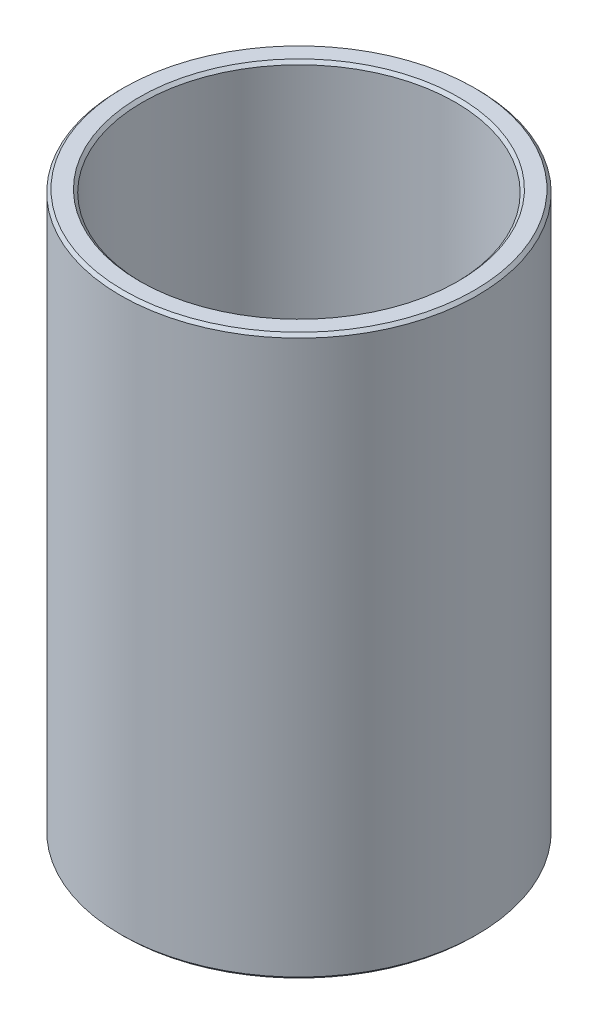
ISO-10303-21;
HEADER;
FILE_DESCRIPTION(('STEP AP214'),'2;1');
FILE_NAME('part.step','',(''),(''),'','','');
FILE_SCHEMA(('AUTOMOTIVE_DESIGN { 1 0 10303 214 1 1 1 1 }'));
ENDSEC;
DATA;
#1=APPLICATION_CONTEXT('core data for automotive mechanical design processes');
#2=APPLICATION_PROTOCOL_DEFINITION('international standard','automotive_design',2000,#1);
#3=PRODUCT_CONTEXT('',#1,'mechanical');
#4=PRODUCT('Part','Part','',(#3));
#5=PRODUCT_RELATED_PRODUCT_CATEGORY('part','',(#4));
#6=PRODUCT_DEFINITION_FORMATION('','',#4);
#7=PRODUCT_DEFINITION_CONTEXT('part definition',#1,'design');
#8=PRODUCT_DEFINITION('design','',#6,#7);
#9=PRODUCT_DEFINITION_SHAPE('','',#8);
#10=(LENGTH_UNIT() NAMED_UNIT(*) SI_UNIT(.MILLI.,.METRE.));
#11=(NAMED_UNIT(*) PLANE_ANGLE_UNIT() SI_UNIT($,.RADIAN.));
#12=(NAMED_UNIT(*) SI_UNIT($,.STERADIAN.) SOLID_ANGLE_UNIT());
#13=UNCERTAINTY_MEASURE_WITH_UNIT(LENGTH_MEASURE(1.E-05),#10,'distance_accuracy_value','');
#14=(GEOMETRIC_REPRESENTATION_CONTEXT(3) GLOBAL_UNCERTAINTY_ASSIGNED_CONTEXT((#13)) GLOBAL_UNIT_ASSIGNED_CONTEXT((#10,
#11,#12)) REPRESENTATION_CONTEXT('',''));
#15=CARTESIAN_POINT('',(0.,0.,0.));
#16=DIRECTION('',(0.,0.,1.));
#17=DIRECTION('',(1.,0.,0.));
#18=AXIS2_PLACEMENT_3D('',#15,#16,#17);
#19=CARTESIAN_POINT('',(0.,101.904696782606,0.));
#20=DIRECTION('',(0.,-1.,0.));
#21=DIRECTION('',(0.,0.,-1.));
#22=AXIS2_PLACEMENT_3D('',#19,#20,#21);
#23=CYLINDRICAL_SURFACE('',#22,32.5);
#24=CARTESIAN_POINT('',(0.,0.548224534452801,0.));
#25=DIRECTION('',(0.,1.,0.));
#26=DIRECTION('',(0.,0.,1.));
#27=AXIS2_PLACEMENT_3D('',#24,#25,#26);
#28=CIRCLE('',#27,32.5);
#29=CARTESIAN_POINT('',(0.,0.548224534452801,32.5));
#30=VERTEX_POINT('',#29);
#31=EDGE_CURVE('E10',#30,#30,#28,.T.);
#32=ORIENTED_EDGE('',*,*,#31,.T.);
#33=EDGE_LOOP('',(#32));
#34=FACE_BOUND('',#33,.T.);
#35=CARTESIAN_POINT('',(0.,101.356472248154,0.));
#36=DIRECTION('',(0.,1.,0.));
#37=DIRECTION('',(0.,0.,1.));
#38=AXIS2_PLACEMENT_3D('',#35,#36,#37);
#39=CIRCLE('',#38,32.5);
#40=CARTESIAN_POINT('',(0.,101.356472248154,32.5));
#41=VERTEX_POINT('',#40);
#42=EDGE_CURVE('E50',#41,#41,#39,.F.);
#43=ORIENTED_EDGE('',*,*,#42,.T.);
#44=EDGE_LOOP('',(#43));
#45=FACE_BOUND('',#44,.T.);
#46=ADVANCED_FACE('F39',(#34,#45),#23,.T.);
#47=CARTESIAN_POINT('',(0.,101.904696782606,0.));
#48=DIRECTION('',(0.,1.,0.));
#49=DIRECTION('',(0.,0.,1.));
#50=AXIS2_PLACEMENT_3D('',#47,#48,#49);
#51=PLANE('',#50);
#52=CARTESIAN_POINT('',(0.,101.904696782606,0.));
#53=DIRECTION('',(0.,1.,0.));
#54=DIRECTION('',(0.,0.,1.));
#55=AXIS2_PLACEMENT_3D('',#52,#53,#54);
#56=CIRCLE('',#55,29.0534049775912);
#57=CARTESIAN_POINT('',(0.,101.904696782606,29.0534049775912));
#58=VERTEX_POINT('',#57);
#59=EDGE_CURVE('E58',#58,#58,#56,.F.);
#60=ORIENTED_EDGE('',*,*,#59,.T.);
#61=EDGE_LOOP('',(#60));
#62=FACE_BOUND('',#61,.T.);
#63=CARTESIAN_POINT('',(0.,101.904696782606,0.));
#64=DIRECTION('',(0.,1.,0.));
#65=DIRECTION('',(0.,0.,1.));
#66=AXIS2_PLACEMENT_3D('',#63,#64,#65);
#67=CIRCLE('',#66,31.9517754655472);
#68=CARTESIAN_POINT('',(0.,101.904696782606,31.9517754655472));
#69=VERTEX_POINT('',#68);
#70=EDGE_CURVE('E61',#69,#69,#67,.T.);
#71=ORIENTED_EDGE('',*,*,#70,.T.);
#72=EDGE_LOOP('',(#71));
#73=FACE_BOUND('',#72,.T.);
#74=ADVANCED_FACE('F88',(#62,#73),#51,.T.);
#75=CARTESIAN_POINT('',(0.,0.,0.));
#76=DIRECTION('',(0.,1.,0.));
#77=DIRECTION('',(0.,0.,1.));
#78=AXIS2_PLACEMENT_3D('',#75,#76,#77);
#79=PLANE('',#78);
#80=CARTESIAN_POINT('',(0.,0.,0.));
#81=DIRECTION('',(0.,1.,0.));
#82=DIRECTION('',(0.,0.,1.));
#83=AXIS2_PLACEMENT_3D('',#80,#81,#82);
#84=CIRCLE('',#83,29.0534049775912);
#85=CARTESIAN_POINT('',(0.,0.,29.0534049775912));
#86=VERTEX_POINT('',#85);
#87=EDGE_CURVE('E51',#86,#86,#84,.T.);
#88=ORIENTED_EDGE('',*,*,#87,.T.);
#89=EDGE_LOOP('',(#88));
#90=FACE_BOUND('',#89,.T.);
#91=CARTESIAN_POINT('',(0.,0.,0.));
#92=DIRECTION('',(0.,1.,0.));
#93=DIRECTION('',(0.,0.,1.));
#94=AXIS2_PLACEMENT_3D('',#91,#92,#93);
#95=CIRCLE('',#94,31.9517754655472);
#96=CARTESIAN_POINT('',(0.,0.,31.9517754655472));
#97=VERTEX_POINT('',#96);
#98=EDGE_CURVE('E54',#97,#97,#95,.F.);
#99=ORIENTED_EDGE('',*,*,#98,.T.);
#100=EDGE_LOOP('',(#99));
#101=FACE_BOUND('',#100,.T.);
#102=ADVANCED_FACE('F83',(#90,#101),#79,.F.);
#103=CARTESIAN_POINT('',(0.,101.904696782606,0.));
#104=DIRECTION('',(0.,-1.,0.));
#105=DIRECTION('',(0.,0.,-1.));
#106=AXIS2_PLACEMENT_3D('',#103,#104,#105);
#107=CYLINDRICAL_SURFACE('',#106,28.5051804431384);
#108=CARTESIAN_POINT('',(0.,101.356472248154,0.));
#109=DIRECTION('',(0.,1.,0.));
#110=DIRECTION('',(0.,0.,1.));
#111=AXIS2_PLACEMENT_3D('',#108,#109,#110);
#112=CIRCLE('',#111,28.5051804431384);
#113=CARTESIAN_POINT('',(0.,101.356472248154,28.5051804431384));
#114=VERTEX_POINT('',#113);
#115=EDGE_CURVE('E67',#114,#114,#112,.T.);
#116=ORIENTED_EDGE('',*,*,#115,.T.);
#117=EDGE_LOOP('',(#116));
#118=FACE_BOUND('',#117,.T.);
#119=CARTESIAN_POINT('',(0.,0.548224534452801,0.));
#120=DIRECTION('',(0.,1.,0.));
#121=DIRECTION('',(0.,0.,1.));
#122=AXIS2_PLACEMENT_3D('',#119,#120,#121);
#123=CIRCLE('',#122,28.5051804431384);
#124=CARTESIAN_POINT('',(0.,0.548224534452801,28.5051804431384));
#125=VERTEX_POINT('',#124);
#126=EDGE_CURVE('E69',#125,#125,#123,.F.);
#127=ORIENTED_EDGE('',*,*,#126,.T.);
#128=EDGE_LOOP('',(#127));
#129=FACE_BOUND('',#128,.T.);
#130=ADVANCED_FACE('F71',(#118,#129),#107,.F.);
#131=CARTESIAN_POINT('',(0.,101.356472248154,0.));
#132=DIRECTION('',(0.,1.,0.));
#133=DIRECTION('',(0.,0.,1.));
#134=AXIS2_PLACEMENT_3D('',#131,#132,#133);
#135=CONICAL_SURFACE('',#134,28.5051804431384,0.785398163397436);
#136=ORIENTED_EDGE('',*,*,#59,.F.);
#137=EDGE_LOOP('',(#136));
#138=FACE_BOUND('',#137,.T.);
#139=ORIENTED_EDGE('',*,*,#115,.F.);
#140=EDGE_LOOP('',(#139));
#141=FACE_BOUND('',#140,.T.);
#142=ADVANCED_FACE('F77',(#138,#141),#135,.F.);
#143=CARTESIAN_POINT('',(0.,0.,0.));
#144=DIRECTION('',(0.,-1.,0.));
#145=DIRECTION('',(0.,0.,-1.));
#146=AXIS2_PLACEMENT_3D('',#143,#144,#145);
#147=CONICAL_SURFACE('',#146,29.0534049775912,0.785398163397436);
#148=ORIENTED_EDGE('',*,*,#126,.F.);
#149=EDGE_LOOP('',(#148));
#150=FACE_BOUND('',#149,.T.);
#151=ORIENTED_EDGE('',*,*,#87,.F.);
#152=EDGE_LOOP('',(#151));
#153=FACE_BOUND('',#152,.T.);
#154=ADVANCED_FACE('F73',(#150,#153),#147,.F.);
#155=CARTESIAN_POINT('',(0.,0.548224534452801,0.));
#156=DIRECTION('',(0.,1.,0.));
#157=DIRECTION('',(0.,0.,1.));
#158=AXIS2_PLACEMENT_3D('',#155,#156,#157);
#159=CONICAL_SURFACE('',#158,32.5,0.785398163397461);
#160=ORIENTED_EDGE('',*,*,#98,.F.);
#161=EDGE_LOOP('',(#160));
#162=FACE_BOUND('',#161,.T.);
#163=ORIENTED_EDGE('',*,*,#31,.F.);
#164=EDGE_LOOP('',(#163));
#165=FACE_BOUND('',#164,.T.);
#166=ADVANCED_FACE('F76',(#162,#165),#159,.T.);
#167=CARTESIAN_POINT('',(0.,101.904696782606,0.));
#168=DIRECTION('',(0.,-1.,0.));
#169=DIRECTION('',(0.,0.,-1.));
#170=AXIS2_PLACEMENT_3D('',#167,#168,#169);
#171=CONICAL_SURFACE('',#170,31.9517754655472,0.785398163397448);
#172=ORIENTED_EDGE('',*,*,#42,.F.);
#173=EDGE_LOOP('',(#172));
#174=FACE_BOUND('',#173,.T.);
#175=ORIENTED_EDGE('',*,*,#70,.F.);
#176=EDGE_LOOP('',(#175));
#177=FACE_BOUND('',#176,.T.);
#178=ADVANCED_FACE('F45',(#174,#177),#171,.T.);
#179=CLOSED_SHELL('',(#46,#74,#102,#130,#142,#154,#166,#178));
#180=MANIFOLD_SOLID_BREP('B2',#179);
#181=ADVANCED_BREP_SHAPE_REPRESENTATION('',(#18,#180),#14);
#182=SHAPE_DEFINITION_REPRESENTATION(#9,#181);
ENDSEC;
END-ISO-10303-21;
